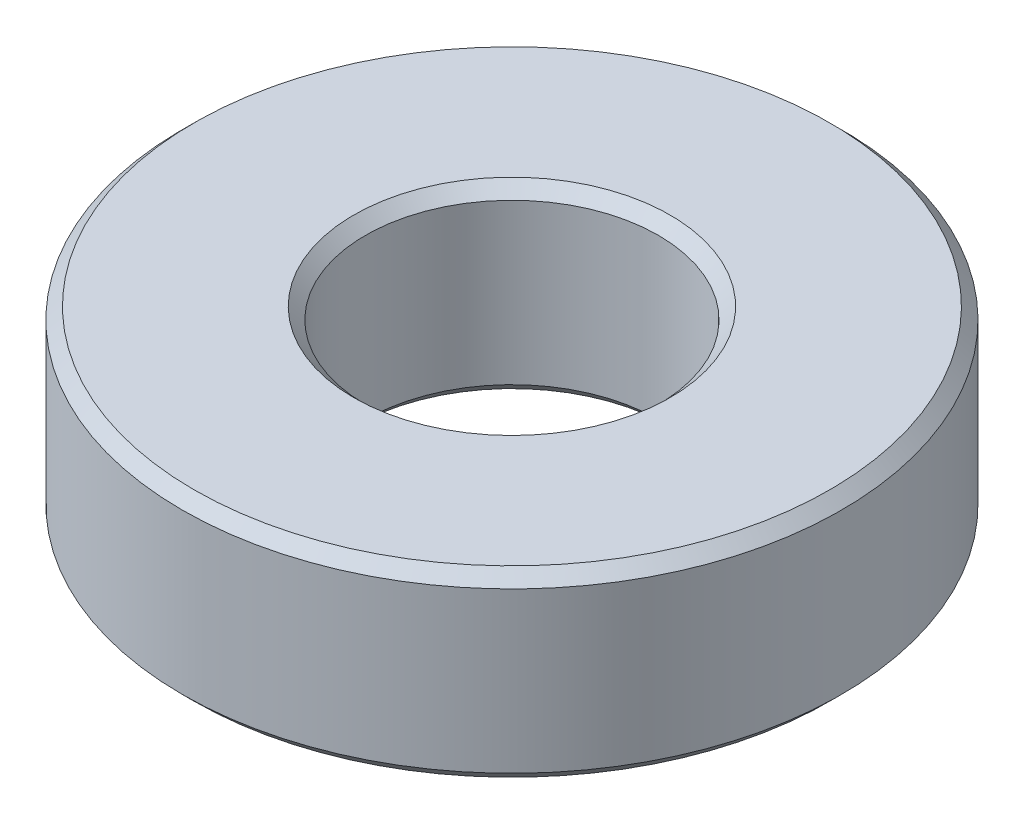
ISO-10303-21;
HEADER;
FILE_DESCRIPTION(('STEP AP214'),'2;1');
FILE_NAME('part.step','',(''),(''),'','','');
FILE_SCHEMA(('AUTOMOTIVE_DESIGN { 1 0 10303 214 1 1 1 1 }'));
ENDSEC;
DATA;
#1=APPLICATION_CONTEXT('core data for automotive mechanical design processes');
#2=APPLICATION_PROTOCOL_DEFINITION('international standard','automotive_design',2000,#1);
#3=PRODUCT_CONTEXT('',#1,'mechanical');
#4=PRODUCT('Part','Part','',(#3));
#5=PRODUCT_RELATED_PRODUCT_CATEGORY('part','',(#4));
#6=PRODUCT_DEFINITION_FORMATION('','',#4);
#7=PRODUCT_DEFINITION_CONTEXT('part definition',#1,'design');
#8=PRODUCT_DEFINITION('design','',#6,#7);
#9=PRODUCT_DEFINITION_SHAPE('','',#8);
#10=(LENGTH_UNIT() NAMED_UNIT(*) SI_UNIT(.MILLI.,.METRE.));
#11=(NAMED_UNIT(*) PLANE_ANGLE_UNIT() SI_UNIT($,.RADIAN.));
#12=(NAMED_UNIT(*) SI_UNIT($,.STERADIAN.) SOLID_ANGLE_UNIT());
#13=UNCERTAINTY_MEASURE_WITH_UNIT(LENGTH_MEASURE(1.E-05),#10,'distance_accuracy_value','');
#14=(GEOMETRIC_REPRESENTATION_CONTEXT(3) GLOBAL_UNCERTAINTY_ASSIGNED_CONTEXT((#13)) GLOBAL_UNIT_ASSIGNED_CONTEXT((#10,
#11,#12)) REPRESENTATION_CONTEXT('',''));
#15=CARTESIAN_POINT('',(0.,0.,0.));
#16=DIRECTION('',(0.,0.,1.));
#17=DIRECTION('',(1.,0.,0.));
#18=AXIS2_PLACEMENT_3D('',#15,#16,#17);
#19=CARTESIAN_POINT('',(0.,-3.96875,0.));
#20=DIRECTION('',(0.,1.,0.));
#21=DIRECTION('',(1.,0.,0.));
#22=AXIS2_PLACEMENT_3D('',#19,#20,#21);
#23=PLANE('',#22);
#24=CARTESIAN_POINT('',(0.,-3.96875,0.));
#25=DIRECTION('',(0.,1.,0.));
#26=DIRECTION('',(0.,0.,1.));
#27=AXIS2_PLACEMENT_3D('',#24,#25,#26);
#28=CIRCLE('',#27,6.858);
#29=CARTESIAN_POINT('',(0.,-3.96875,6.858));
#30=VERTEX_POINT('',#29);
#31=EDGE_CURVE('E10',#30,#30,#28,.T.);
#32=ORIENTED_EDGE('',*,*,#31,.T.);
#33=EDGE_LOOP('',(#32));
#34=FACE_BOUND('',#33,.T.);
#35=CARTESIAN_POINT('',(0.,-3.96875,0.));
#36=DIRECTION('',(0.,-1.,0.));
#37=DIRECTION('',(0.,0.,1.));
#38=AXIS2_PLACEMENT_3D('',#35,#36,#37);
#39=CIRCLE('',#38,13.7795);
#40=CARTESIAN_POINT('',(0.,-3.96875,13.7795));
#41=VERTEX_POINT('',#40);
#42=EDGE_CURVE('E36',#41,#41,#39,.T.);
#43=ORIENTED_EDGE('',*,*,#42,.T.);
#44=EDGE_LOOP('',(#43));
#45=FACE_BOUND('',#44,.T.);
#46=ADVANCED_FACE('F14',(#34,#45),#23,.F.);
#47=CARTESIAN_POINT('',(0.,3.96875,0.));
#48=DIRECTION('',(0.,1.,0.));
#49=DIRECTION('',(1.,0.,0.));
#50=AXIS2_PLACEMENT_3D('',#47,#48,#49);
#51=PLANE('',#50);
#52=CARTESIAN_POINT('',(0.,3.96875,0.));
#53=DIRECTION('',(0.,-1.,0.));
#54=DIRECTION('',(0.,0.,1.));
#55=AXIS2_PLACEMENT_3D('',#52,#53,#54);
#56=CIRCLE('',#55,6.858);
#57=CARTESIAN_POINT('',(0.,3.96875,6.858));
#58=VERTEX_POINT('',#57);
#59=EDGE_CURVE('E41',#58,#58,#56,.T.);
#60=ORIENTED_EDGE('',*,*,#59,.T.);
#61=EDGE_LOOP('',(#60));
#62=FACE_BOUND('',#61,.T.);
#63=CARTESIAN_POINT('',(0.,3.96875,0.));
#64=DIRECTION('',(0.,1.,0.));
#65=DIRECTION('',(0.,0.,1.));
#66=AXIS2_PLACEMENT_3D('',#63,#64,#65);
#67=CIRCLE('',#66,13.7795);
#68=CARTESIAN_POINT('',(0.,3.96875,13.7795));
#69=VERTEX_POINT('',#68);
#70=EDGE_CURVE('E57',#69,#69,#67,.T.);
#71=ORIENTED_EDGE('',*,*,#70,.T.);
#72=EDGE_LOOP('',(#71));
#73=FACE_BOUND('',#72,.T.);
#74=ADVANCED_FACE('F64',(#62,#73),#51,.T.);
#75=CARTESIAN_POINT('',(0.,3.96875,0.));
#76=DIRECTION('',(0.,-1.,0.));
#77=DIRECTION('',(0.,0.,-1.));
#78=AXIS2_PLACEMENT_3D('',#75,#76,#77);
#79=CYLINDRICAL_SURFACE('',#78,14.2875);
#80=CARTESIAN_POINT('',(0.,-3.46075,0.));
#81=DIRECTION('',(0.,1.,0.));
#82=DIRECTION('',(0.,0.,1.));
#83=AXIS2_PLACEMENT_3D('',#80,#81,#82);
#84=CIRCLE('',#83,14.2875);
#85=CARTESIAN_POINT('',(0.,-3.46075,14.2875));
#86=VERTEX_POINT('',#85);
#87=EDGE_CURVE('E33',#86,#86,#84,.T.);
#88=ORIENTED_EDGE('',*,*,#87,.T.);
#89=EDGE_LOOP('',(#88));
#90=FACE_BOUND('',#89,.T.);
#91=CARTESIAN_POINT('',(0.,3.46075,0.));
#92=DIRECTION('',(0.,-1.,0.));
#93=DIRECTION('',(0.,0.,1.));
#94=AXIS2_PLACEMENT_3D('',#91,#92,#93);
#95=CIRCLE('',#94,14.2875);
#96=CARTESIAN_POINT('',(0.,3.46075,14.2875));
#97=VERTEX_POINT('',#96);
#98=EDGE_CURVE('E55',#97,#97,#95,.T.);
#99=ORIENTED_EDGE('',*,*,#98,.T.);
#100=EDGE_LOOP('',(#99));
#101=FACE_BOUND('',#100,.T.);
#102=ADVANCED_FACE('F16',(#90,#101),#79,.T.);
#103=CARTESIAN_POINT('',(0.,3.96875,0.));
#104=DIRECTION('',(0.,-1.,0.));
#105=DIRECTION('',(0.,0.,-1.));
#106=AXIS2_PLACEMENT_3D('',#103,#104,#105);
#107=CYLINDRICAL_SURFACE('',#106,6.35);
#108=CARTESIAN_POINT('',(0.,-3.46075,0.));
#109=DIRECTION('',(0.,-1.,0.));
#110=DIRECTION('',(0.,0.,1.));
#111=AXIS2_PLACEMENT_3D('',#108,#109,#110);
#112=CIRCLE('',#111,6.35);
#113=CARTESIAN_POINT('',(0.,-3.46075,6.35));
#114=VERTEX_POINT('',#113);
#115=EDGE_CURVE('E22',#114,#114,#112,.T.);
#116=ORIENTED_EDGE('',*,*,#115,.T.);
#117=EDGE_LOOP('',(#116));
#118=FACE_BOUND('',#117,.T.);
#119=CARTESIAN_POINT('',(0.,3.46075,0.));
#120=DIRECTION('',(0.,1.,0.));
#121=DIRECTION('',(0.,0.,1.));
#122=AXIS2_PLACEMENT_3D('',#119,#120,#121);
#123=CIRCLE('',#122,6.35);
#124=CARTESIAN_POINT('',(0.,3.46075,6.35));
#125=VERTEX_POINT('',#124);
#126=EDGE_CURVE('E44',#125,#125,#123,.T.);
#127=ORIENTED_EDGE('',*,*,#126,.T.);
#128=EDGE_LOOP('',(#127));
#129=FACE_BOUND('',#128,.T.);
#130=ADVANCED_FACE('F95',(#118,#129),#107,.F.);
#131=CARTESIAN_POINT('',(0.,-3.96875,0.));
#132=DIRECTION('',(0.,-1.,0.));
#133=DIRECTION('',(0.,0.,-1.));
#134=AXIS2_PLACEMENT_3D('',#131,#132,#133);
#135=CONICAL_SURFACE('',#134,6.858,0.785398163397446);
#136=ORIENTED_EDGE('',*,*,#31,.F.);
#137=EDGE_LOOP('',(#136));
#138=FACE_BOUND('',#137,.T.);
#139=ORIENTED_EDGE('',*,*,#115,.F.);
#140=EDGE_LOOP('',(#139));
#141=FACE_BOUND('',#140,.T.);
#142=ADVANCED_FACE('F90',(#138,#141),#135,.F.);
#143=CARTESIAN_POINT('',(0.,-3.46075,0.));
#144=DIRECTION('',(0.,1.,0.));
#145=DIRECTION('',(0.,0.,1.));
#146=AXIS2_PLACEMENT_3D('',#143,#144,#145);
#147=CONICAL_SURFACE('',#146,14.2875,0.78539816339745);
#148=ORIENTED_EDGE('',*,*,#87,.F.);
#149=EDGE_LOOP('',(#148));
#150=FACE_BOUND('',#149,.T.);
#151=ORIENTED_EDGE('',*,*,#42,.F.);
#152=EDGE_LOOP('',(#151));
#153=FACE_BOUND('',#152,.T.);
#154=ADVANCED_FACE('F72',(#150,#153),#147,.T.);
#155=CARTESIAN_POINT('',(0.,3.46075,0.));
#156=DIRECTION('',(0.,1.,0.));
#157=DIRECTION('',(0.,0.,1.));
#158=AXIS2_PLACEMENT_3D('',#155,#156,#157);
#159=CONICAL_SURFACE('',#158,6.35,0.78539816339745);
#160=ORIENTED_EDGE('',*,*,#59,.F.);
#161=EDGE_LOOP('',(#160));
#162=FACE_BOUND('',#161,.T.);
#163=ORIENTED_EDGE('',*,*,#126,.F.);
#164=EDGE_LOOP('',(#163));
#165=FACE_BOUND('',#164,.T.);
#166=ADVANCED_FACE('F70',(#162,#165),#159,.F.);
#167=CARTESIAN_POINT('',(0.,3.96875,0.));
#168=DIRECTION('',(0.,-1.,0.));
#169=DIRECTION('',(0.,0.,-1.));
#170=AXIS2_PLACEMENT_3D('',#167,#168,#169);
#171=CONICAL_SURFACE('',#170,13.7795,0.785398163397442);
#172=ORIENTED_EDGE('',*,*,#98,.F.);
#173=EDGE_LOOP('',(#172));
#174=FACE_BOUND('',#173,.T.);
#175=ORIENTED_EDGE('',*,*,#70,.F.);
#176=EDGE_LOOP('',(#175));
#177=FACE_BOUND('',#176,.T.);
#178=ADVANCED_FACE('F65',(#174,#177),#171,.T.);
#179=CLOSED_SHELL('',(#46,#74,#102,#130,#142,#154,#166,#178));
#180=MANIFOLD_SOLID_BREP('B1',#179);
#181=ADVANCED_BREP_SHAPE_REPRESENTATION('',(#18,#180),#14);
#182=SHAPE_DEFINITION_REPRESENTATION(#9,#181);
ENDSEC;
END-ISO-10303-21;
